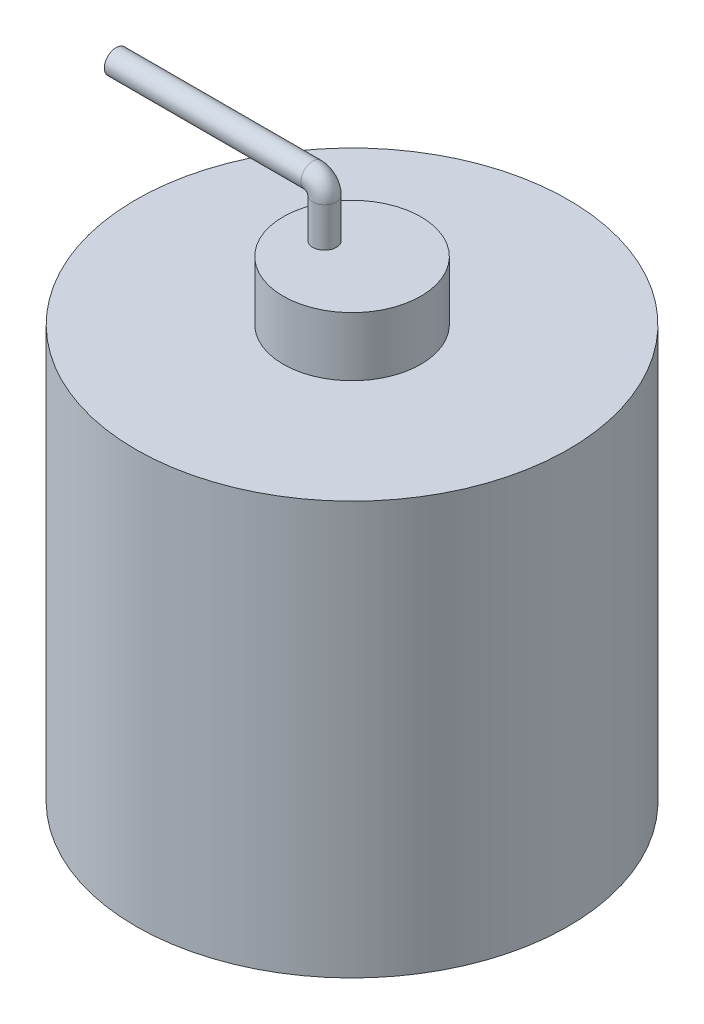
ISO-10303-21;
HEADER;
FILE_DESCRIPTION(('STEP AP214'),'2;1');
FILE_NAME('part.step','',(''),(''),'','','');
FILE_SCHEMA(('AUTOMOTIVE_DESIGN { 1 0 10303 214 1 1 1 1 }'));
ENDSEC;
DATA;
#1=APPLICATION_CONTEXT('core data for automotive mechanical design processes');
#2=APPLICATION_PROTOCOL_DEFINITION('international standard','automotive_design',2000,#1);
#3=PRODUCT_CONTEXT('',#1,'mechanical');
#4=PRODUCT('Part','Part','',(#3));
#5=PRODUCT_RELATED_PRODUCT_CATEGORY('part','',(#4));
#6=PRODUCT_DEFINITION_FORMATION('','',#4);
#7=PRODUCT_DEFINITION_CONTEXT('part definition',#1,'design');
#8=PRODUCT_DEFINITION('design','',#6,#7);
#9=PRODUCT_DEFINITION_SHAPE('','',#8);
#10=(LENGTH_UNIT() NAMED_UNIT(*) SI_UNIT(.MILLI.,.METRE.));
#11=(NAMED_UNIT(*) PLANE_ANGLE_UNIT() SI_UNIT($,.RADIAN.));
#12=(NAMED_UNIT(*) SI_UNIT($,.STERADIAN.) SOLID_ANGLE_UNIT());
#13=UNCERTAINTY_MEASURE_WITH_UNIT(LENGTH_MEASURE(1.E-05),#10,'distance_accuracy_value','');
#14=(GEOMETRIC_REPRESENTATION_CONTEXT(3) GLOBAL_UNCERTAINTY_ASSIGNED_CONTEXT((#13)) GLOBAL_UNIT_ASSIGNED_CONTEXT((#10,
#11,#12)) REPRESENTATION_CONTEXT('',''));
#15=CARTESIAN_POINT('',(0.,0.,0.));
#16=DIRECTION('',(0.,0.,1.));
#17=DIRECTION('',(1.,0.,0.));
#18=AXIS2_PLACEMENT_3D('',#15,#16,#17);
#19=CARTESIAN_POINT('',(0.,210.,0.));
#20=DIRECTION('',(0.,1.,0.));
#21=DIRECTION('',(0.,0.,1.));
#22=AXIS2_PLACEMENT_3D('',#19,#20,#21);
#23=PLANE('',#22);
#24=CARTESIAN_POINT('',(0.,210.,0.));
#25=DIRECTION('',(0.,1.,0.));
#26=DIRECTION('',(0.,0.,1.));
#27=AXIS2_PLACEMENT_3D('',#24,#25,#26);
#28=CIRCLE('',#27,110.);
#29=CARTESIAN_POINT('',(0.,210.,110.));
#30=VERTEX_POINT('',#29);
#31=EDGE_CURVE('E104',#30,#30,#28,.T.);
#32=ORIENTED_EDGE('',*,*,#31,.T.);
#33=EDGE_LOOP('',(#32));
#34=FACE_BOUND('',#33,.T.);
#35=CARTESIAN_POINT('',(0.,210.,0.));
#36=DIRECTION('',(0.,1.,0.));
#37=DIRECTION('',(0.,0.,1.));
#38=AXIS2_PLACEMENT_3D('',#35,#36,#37);
#39=CIRCLE('',#38,35.);
#40=CARTESIAN_POINT('',(0.,210.,35.));
#41=VERTEX_POINT('',#40);
#42=EDGE_CURVE('E112',#41,#41,#39,.T.);
#43=ORIENTED_EDGE('',*,*,#42,.F.);
#44=EDGE_LOOP('',(#43));
#45=FACE_BOUND('',#44,.T.);
#46=ADVANCED_FACE('F59',(#34,#45),#23,.T.);
#47=CARTESIAN_POINT('',(0.,0.,0.));
#48=DIRECTION('',(0.,1.,0.));
#49=DIRECTION('',(0.,0.,1.));
#50=AXIS2_PLACEMENT_3D('',#47,#48,#49);
#51=PLANE('',#50);
#52=CARTESIAN_POINT('',(0.,0.,0.));
#53=DIRECTION('',(0.,1.,0.));
#54=DIRECTION('',(0.,0.,1.));
#55=AXIS2_PLACEMENT_3D('',#52,#53,#54);
#56=CIRCLE('',#55,110.);
#57=CARTESIAN_POINT('',(0.,0.,110.));
#58=VERTEX_POINT('',#57);
#59=EDGE_CURVE('E12',#58,#58,#56,.T.);
#60=ORIENTED_EDGE('',*,*,#59,.F.);
#61=EDGE_LOOP('',(#60));
#62=FACE_BOUND('',#61,.T.);
#63=CARTESIAN_POINT('',(0.,0.,0.));
#64=DIRECTION('',(0.,1.,0.));
#65=DIRECTION('',(0.,0.,1.));
#66=AXIS2_PLACEMENT_3D('',#63,#64,#65);
#67=CIRCLE('',#66,100.);
#68=CARTESIAN_POINT('',(0.,0.,100.));
#69=VERTEX_POINT('',#68);
#70=EDGE_CURVE('E68',#69,#69,#67,.T.);
#71=ORIENTED_EDGE('',*,*,#70,.T.);
#72=EDGE_LOOP('',(#71));
#73=FACE_BOUND('',#72,.T.);
#74=ADVANCED_FACE('F163',(#62,#73),#51,.F.);
#75=CARTESIAN_POINT('',(0.,200.,0.));
#76=DIRECTION('',(0.,-1.,0.));
#77=DIRECTION('',(0.,0.,-1.));
#78=AXIS2_PLACEMENT_3D('',#75,#76,#77);
#79=CYLINDRICAL_SURFACE('',#78,110.);
#80=ORIENTED_EDGE('',*,*,#59,.T.);
#81=EDGE_LOOP('',(#80));
#82=FACE_BOUND('',#81,.T.);
#83=ORIENTED_EDGE('',*,*,#31,.F.);
#84=EDGE_LOOP('',(#83));
#85=FACE_BOUND('',#84,.T.);
#86=ADVANCED_FACE('F61',(#82,#85),#79,.T.);
#87=CARTESIAN_POINT('',(0.,200.,0.));
#88=DIRECTION('',(0.,-1.,0.));
#89=DIRECTION('',(0.,0.,-1.));
#90=AXIS2_PLACEMENT_3D('',#87,#88,#89);
#91=CYLINDRICAL_SURFACE('',#90,100.);
#92=CARTESIAN_POINT('',(0.,200.,0.));
#93=DIRECTION('',(0.,1.,0.));
#94=DIRECTION('',(0.,0.,1.));
#95=AXIS2_PLACEMENT_3D('',#92,#93,#94);
#96=CIRCLE('',#95,100.);
#97=CARTESIAN_POINT('',(0.,200.,100.));
#98=VERTEX_POINT('',#97);
#99=EDGE_CURVE('E100',#98,#98,#96,.T.);
#100=ORIENTED_EDGE('',*,*,#99,.T.);
#101=EDGE_LOOP('',(#100));
#102=FACE_BOUND('',#101,.T.);
#103=ORIENTED_EDGE('',*,*,#70,.F.);
#104=EDGE_LOOP('',(#103));
#105=FACE_BOUND('',#104,.T.);
#106=ADVANCED_FACE('F179',(#102,#105),#91,.F.);
#107=CARTESIAN_POINT('',(0.,200.,0.));
#108=DIRECTION('',(0.,1.,0.));
#109=DIRECTION('',(0.,0.,1.));
#110=AXIS2_PLACEMENT_3D('',#107,#108,#109);
#111=PLANE('',#110);
#112=CARTESIAN_POINT('',(0.,200.,0.));
#113=DIRECTION('',(0.,1.,0.));
#114=DIRECTION('',(0.,0.,1.));
#115=AXIS2_PLACEMENT_3D('',#112,#113,#114);
#116=CIRCLE('',#115,25.);
#117=CARTESIAN_POINT('',(0.,200.,25.));
#118=VERTEX_POINT('',#117);
#119=EDGE_CURVE('E108',#118,#118,#116,.T.);
#120=ORIENTED_EDGE('',*,*,#119,.T.);
#121=EDGE_LOOP('',(#120));
#122=FACE_BOUND('',#121,.T.);
#123=ORIENTED_EDGE('',*,*,#99,.F.);
#124=EDGE_LOOP('',(#123));
#125=FACE_BOUND('',#124,.T.);
#126=ADVANCED_FACE('F177',(#122,#125),#111,.F.);
#127=CARTESIAN_POINT('',(0.,210.,0.));
#128=DIRECTION('',(0.,-1.,0.));
#129=DIRECTION('',(0.,0.,-1.));
#130=AXIS2_PLACEMENT_3D('',#127,#128,#129);
#131=CYLINDRICAL_SURFACE('',#130,25.);
#132=ORIENTED_EDGE('',*,*,#119,.F.);
#133=EDGE_LOOP('',(#132));
#134=FACE_BOUND('',#133,.T.);
#135=CARTESIAN_POINT('',(0.,230.,0.));
#136=DIRECTION('',(0.,1.,0.));
#137=DIRECTION('',(0.,0.,1.));
#138=AXIS2_PLACEMENT_3D('',#135,#136,#137);
#139=CIRCLE('',#138,25.);
#140=CARTESIAN_POINT('',(0.,230.,25.));
#141=VERTEX_POINT('',#140);
#142=EDGE_CURVE('E116',#141,#141,#139,.T.);
#143=ORIENTED_EDGE('',*,*,#142,.T.);
#144=EDGE_LOOP('',(#143));
#145=FACE_BOUND('',#144,.T.);
#146=ADVANCED_FACE('F175',(#134,#145),#131,.F.);
#147=CARTESIAN_POINT('',(0.,230.,0.));
#148=DIRECTION('',(0.,-1.,0.));
#149=DIRECTION('',(0.,0.,-1.));
#150=AXIS2_PLACEMENT_3D('',#147,#148,#149);
#151=CYLINDRICAL_SURFACE('',#150,35.);
#152=ORIENTED_EDGE('',*,*,#42,.T.);
#153=EDGE_LOOP('',(#152));
#154=FACE_BOUND('',#153,.T.);
#155=CARTESIAN_POINT('',(0.,240.,0.));
#156=DIRECTION('',(0.,1.,0.));
#157=DIRECTION('',(0.,0.,1.));
#158=AXIS2_PLACEMENT_3D('',#155,#156,#157);
#159=CIRCLE('',#158,35.);
#160=CARTESIAN_POINT('',(0.,240.,35.));
#161=VERTEX_POINT('',#160);
#162=EDGE_CURVE('E94',#161,#161,#159,.T.);
#163=ORIENTED_EDGE('',*,*,#162,.F.);
#164=EDGE_LOOP('',(#163));
#165=FACE_BOUND('',#164,.T.);
#166=ADVANCED_FACE('F213',(#154,#165),#151,.T.);
#167=CARTESIAN_POINT('',(0.,230.,0.));
#168=DIRECTION('',(0.,1.,0.));
#169=DIRECTION('',(0.,0.,1.));
#170=AXIS2_PLACEMENT_3D('',#167,#168,#169);
#171=PLANE('',#170);
#172=CARTESIAN_POINT('',(-14.,230.,0.));
#173=DIRECTION('',(0.,1.,0.));
#174=DIRECTION('',(0.,0.,1.));
#175=AXIS2_PLACEMENT_3D('',#172,#173,#174);
#176=CIRCLE('',#175,6.);
#177=CARTESIAN_POINT('',(-14.,230.,6.00000000000001));
#178=VERTEX_POINT('',#177);
#179=EDGE_CURVE('E126',#178,#178,#176,.T.);
#180=ORIENTED_EDGE('',*,*,#179,.T.);
#181=EDGE_LOOP('',(#180));
#182=FACE_BOUND('',#181,.T.);
#183=ORIENTED_EDGE('',*,*,#142,.F.);
#184=EDGE_LOOP('',(#183));
#185=FACE_BOUND('',#184,.T.);
#186=ADVANCED_FACE('F226',(#182,#185),#171,.F.);
#187=CARTESIAN_POINT('',(0.,240.,0.));
#188=DIRECTION('',(0.,1.,0.));
#189=DIRECTION('',(0.,0.,1.));
#190=AXIS2_PLACEMENT_3D('',#187,#188,#189);
#191=PLANE('',#190);
#192=CARTESIAN_POINT('',(-14.,240.,0.));
#193=DIRECTION('',(0.,1.,0.));
#194=DIRECTION('',(0.,0.,1.));
#195=AXIS2_PLACEMENT_3D('',#192,#193,#194);
#196=CIRCLE('',#195,6.);
#197=CARTESIAN_POINT('',(-14.,240.,6.00000000000001));
#198=VERTEX_POINT('',#197);
#199=EDGE_CURVE('E95',#198,#198,#196,.T.);
#200=ORIENTED_EDGE('',*,*,#199,.F.);
#201=EDGE_LOOP('',(#200));
#202=FACE_BOUND('',#201,.T.);
#203=ORIENTED_EDGE('',*,*,#162,.T.);
#204=EDGE_LOOP('',(#203));
#205=FACE_BOUND('',#204,.T.);
#206=ADVANCED_FACE('F235',(#202,#205),#191,.T.);
#207=CARTESIAN_POINT('',(-14.,260.,0.));
#208=DIRECTION('',(0.,-1.,0.));
#209=DIRECTION('',(0.,0.,-1.));
#210=AXIS2_PLACEMENT_3D('',#207,#208,#209);
#211=CYLINDRICAL_SURFACE('',#210,5.);
#212=CARTESIAN_POINT('',(-14.,260.,0.));
#213=DIRECTION('',(0.,-1.,0.));
#214=DIRECTION('',(0.,0.,-1.));
#215=AXIS2_PLACEMENT_3D('',#212,#213,#214);
#216=CIRCLE('',#215,5.00000000000001);
#217=CARTESIAN_POINT('',(-9.00000000000001,260.,0.));
#218=VERTEX_POINT('',#217);
#219=EDGE_CURVE('E80',#218,#218,#216,.F.);
#220=ORIENTED_EDGE('',*,*,#219,.T.);
#221=EDGE_LOOP('',(#220));
#222=FACE_BOUND('',#221,.T.);
#223=CARTESIAN_POINT('',(-14.,10.,0.));
#224=DIRECTION('',(0.,1.,0.));
#225=DIRECTION('',(0.,0.,1.));
#226=AXIS2_PLACEMENT_3D('',#223,#224,#225);
#227=CIRCLE('',#226,5.);
#228=CARTESIAN_POINT('',(-14.,10.,5.));
#229=VERTEX_POINT('',#228);
#230=EDGE_CURVE('E134',#229,#229,#227,.T.);
#231=ORIENTED_EDGE('',*,*,#230,.F.);
#232=EDGE_LOOP('',(#231));
#233=FACE_BOUND('',#232,.T.);
#234=ADVANCED_FACE('F244',(#222,#233),#211,.F.);
#235=CARTESIAN_POINT('',(-14.,260.,0.));
#236=DIRECTION('',(0.,-1.,0.));
#237=DIRECTION('',(0.,0.,-1.));
#238=AXIS2_PLACEMENT_3D('',#235,#236,#237);
#239=CYLINDRICAL_SURFACE('',#238,6.);
#240=CARTESIAN_POINT('',(-14.,260.,0.));
#241=DIRECTION('',(0.,1.,0.));
#242=DIRECTION('',(0.,0.,1.));
#243=AXIS2_PLACEMENT_3D('',#240,#241,#242);
#244=CIRCLE('',#243,6.);
#245=CARTESIAN_POINT('',(-20.,260.,0.));
#246=VERTEX_POINT('',#245);
#247=EDGE_CURVE('E77',#246,#246,#244,.T.);
#248=ORIENTED_EDGE('',*,*,#247,.F.);
#249=EDGE_LOOP('',(#248));
#250=FACE_BOUND('',#249,.T.);
#251=ORIENTED_EDGE('',*,*,#199,.T.);
#252=EDGE_LOOP('',(#251));
#253=FACE_BOUND('',#252,.T.);
#254=ADVANCED_FACE('F253',(#250,#253),#239,.T.);
#255=CARTESIAN_POINT('',(-14.,10.,0.));
#256=DIRECTION('',(0.,1.,0.));
#257=DIRECTION('',(0.,0.,1.));
#258=AXIS2_PLACEMENT_3D('',#255,#256,#257);
#259=CYLINDRICAL_SURFACE('',#258,6.);
#260=CARTESIAN_POINT('',(-14.,10.,0.));
#261=DIRECTION('',(0.,1.,0.));
#262=DIRECTION('',(0.,0.,1.));
#263=AXIS2_PLACEMENT_3D('',#260,#261,#262);
#264=CIRCLE('',#263,6.);
#265=CARTESIAN_POINT('',(-14.,10.,6.00000000000001));
#266=VERTEX_POINT('',#265);
#267=EDGE_CURVE('E130',#266,#266,#264,.T.);
#268=ORIENTED_EDGE('',*,*,#267,.T.);
#269=EDGE_LOOP('',(#268));
#270=FACE_BOUND('',#269,.T.);
#271=ORIENTED_EDGE('',*,*,#179,.F.);
#272=EDGE_LOOP('',(#271));
#273=FACE_BOUND('',#272,.T.);
#274=ADVANCED_FACE('F263',(#270,#273),#259,.T.);
#275=CARTESIAN_POINT('',(-14.,10.,0.));
#276=DIRECTION('',(0.,1.,0.));
#277=DIRECTION('',(0.,0.,1.));
#278=AXIS2_PLACEMENT_3D('',#275,#276,#277);
#279=PLANE('',#278);
#280=ORIENTED_EDGE('',*,*,#230,.T.);
#281=EDGE_LOOP('',(#280));
#282=FACE_BOUND('',#281,.T.);
#283=ORIENTED_EDGE('',*,*,#267,.F.);
#284=EDGE_LOOP('',(#283));
#285=FACE_BOUND('',#284,.T.);
#286=ADVANCED_FACE('F272',(#282,#285),#279,.F.);
#287=CARTESIAN_POINT('',(-14.,260.,0.));
#288=DIRECTION('',(0.,-1.,0.));
#289=DIRECTION('',(1.,0.,0.));
#290=AXIS2_PLACEMENT_3D('',#287,#288,#289);
#291=CIRCLE('',#290,6.00000000000001);
#292=TRIMMED_CURVE('',#291,(PARAMETER_VALUE(-3.14159257908399)),
(PARAMETER_VALUE(3.14159257908399)),.T.,.PARAMETER.);
#293=CARTESIAN_POINT('',(-20.,260.,0.));
#294=DIRECTION('',(0.,0.,1.));
#295=AXIS1_PLACEMENT('',#293,#294);
#296=SURFACE_OF_REVOLUTION('',#292,#295);
#297=CARTESIAN_POINT('',(-20.,266.,0.));
#298=DIRECTION('',(1.,0.,0.));
#299=DIRECTION('',(0.,0.,-1.));
#300=AXIS2_PLACEMENT_3D('',#297,#298,#299);
#301=CIRCLE('',#300,6.00000000000001);
#302=EDGE_CURVE('E74',#246,#246,#301,.T.);
#303=ORIENTED_EDGE('',*,*,#302,.T.);
#304=ORIENTED_EDGE('',*,*,#247,.T.);
#305=EDGE_LOOP('',(#303,#304));
#306=FACE_BOUND('',#305,.T.);
#307=ADVANCED_FACE('F75',(#306),#296,.T.);
#308=CARTESIAN_POINT('',(-20.,260.,0.));
#309=DIRECTION('',(0.,0.,1.));
#310=DIRECTION('',(1.,0.,0.));
#311=AXIS2_PLACEMENT_3D('',#308,#309,#310);
#312=TOROIDAL_SURFACE('',#311,5.99999999999999,5.00000000000001);
#313=CARTESIAN_POINT('',(-20.,266.,0.));
#314=DIRECTION('',(1.,0.,0.));
#315=DIRECTION('',(0.,0.,-1.));
#316=AXIS2_PLACEMENT_3D('',#313,#314,#315);
#317=CIRCLE('',#316,5.00000000000001);
#318=CARTESIAN_POINT('',(-20.,271.,0.));
#319=VERTEX_POINT('',#318);
#320=EDGE_CURVE('E85',#319,#319,#317,.F.);
#321=CARTESIAN_POINT('',(-20.,260.,0.));
#322=DIRECTION('',(0.,0.,1.));
#323=DIRECTION('',(1.,0.,0.));
#324=AXIS2_PLACEMENT_3D('',#321,#322,#323);
#325=CIRCLE('',#324,11.);
#326=EDGE_CURVE('',#218,#319,#325,.T.);
#327=ORIENTED_EDGE('',*,*,#219,.F.);
#328=ORIENTED_EDGE('',*,*,#320,.T.);
#329=ORIENTED_EDGE('',*,*,#326,.T.);
#330=ORIENTED_EDGE('',*,*,#326,.F.);
#331=EDGE_LOOP('',(#327,#329,#328,#330));
#332=FACE_BOUND('',#331,.T.);
#333=ADVANCED_FACE('F160',(#332),#312,.F.);
#334=CARTESIAN_POINT('',(-120.,266.,0.));
#335=DIRECTION('',(1.,0.,0.));
#336=DIRECTION('',(0.,0.,-1.));
#337=AXIS2_PLACEMENT_3D('',#334,#335,#336);
#338=CYLINDRICAL_SURFACE('',#337,5.);
#339=CARTESIAN_POINT('',(-120.,266.,0.));
#340=DIRECTION('',(-1.,0.,0.));
#341=DIRECTION('',(0.,0.,1.));
#342=AXIS2_PLACEMENT_3D('',#339,#340,#341);
#343=CIRCLE('',#342,5.);
#344=CARTESIAN_POINT('',(-120.,266.,5.));
#345=VERTEX_POINT('',#344);
#346=EDGE_CURVE('E88',#345,#345,#343,.T.);
#347=ORIENTED_EDGE('',*,*,#346,.T.);
#348=EDGE_LOOP('',(#347));
#349=FACE_BOUND('',#348,.T.);
#350=ORIENTED_EDGE('',*,*,#320,.F.);
#351=EDGE_LOOP('',(#350));
#352=FACE_BOUND('',#351,.T.);
#353=ADVANCED_FACE('F145',(#349,#352),#338,.F.);
#354=CARTESIAN_POINT('',(-120.,266.,0.));
#355=DIRECTION('',(1.,0.,0.));
#356=DIRECTION('',(0.,0.,-1.));
#357=AXIS2_PLACEMENT_3D('',#354,#355,#356);
#358=CYLINDRICAL_SURFACE('',#357,6.00000000000001);
#359=CARTESIAN_POINT('',(-120.,266.,0.));
#360=DIRECTION('',(-1.,0.,0.));
#361=DIRECTION('',(0.,0.,1.));
#362=AXIS2_PLACEMENT_3D('',#359,#360,#361);
#363=CIRCLE('',#362,6.00000000000001);
#364=CARTESIAN_POINT('',(-120.,266.,6.00000000000001));
#365=VERTEX_POINT('',#364);
#366=EDGE_CURVE('E81',#365,#365,#363,.T.);
#367=ORIENTED_EDGE('',*,*,#366,.F.);
#368=EDGE_LOOP('',(#367));
#369=FACE_BOUND('',#368,.T.);
#370=ORIENTED_EDGE('',*,*,#302,.F.);
#371=EDGE_LOOP('',(#370));
#372=FACE_BOUND('',#371,.T.);
#373=ADVANCED_FACE('F151',(#369,#372),#358,.T.);
#374=CARTESIAN_POINT('',(-120.,0.,0.));
#375=DIRECTION('',(-1.,0.,0.));
#376=DIRECTION('',(0.,0.,1.));
#377=AXIS2_PLACEMENT_3D('',#374,#375,#376);
#378=PLANE('',#377);
#379=ORIENTED_EDGE('',*,*,#346,.F.);
#380=EDGE_LOOP('',(#379));
#381=FACE_BOUND('',#380,.T.);
#382=ORIENTED_EDGE('',*,*,#366,.T.);
#383=EDGE_LOOP('',(#382));
#384=FACE_BOUND('',#383,.T.);
#385=ADVANCED_FACE('F148',(#381,#384),#378,.T.);
#386=CLOSED_SHELL('',(#46,#74,#86,#106,#126,#146,#166,#186,#206,#234,#254,#274,#286,#307,#333,
#353,#373,#385));
#387=MANIFOLD_SOLID_BREP('B2',#386);
#388=ADVANCED_BREP_SHAPE_REPRESENTATION('',(#18,#387),#14);
#389=SHAPE_DEFINITION_REPRESENTATION(#9,#388);
ENDSEC;
END-ISO-10303-21;
